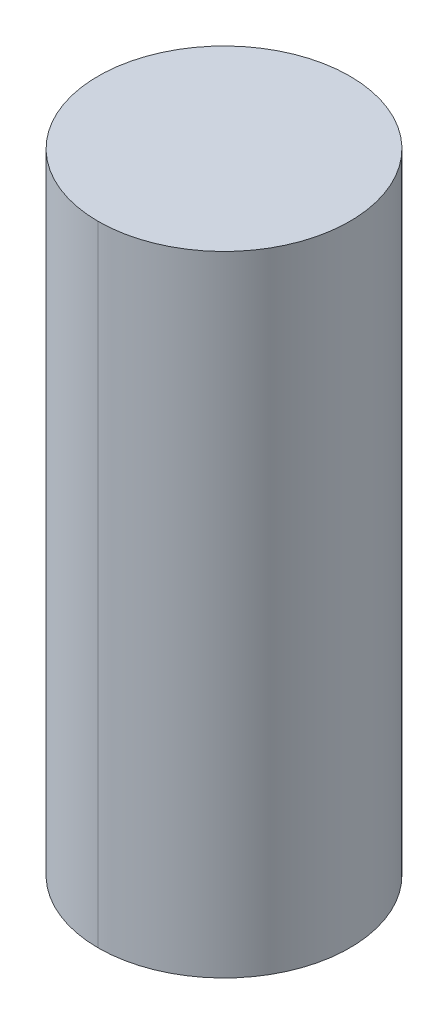
ISO-10303-21;
HEADER;
FILE_DESCRIPTION(('STEP AP214'),'2;1');
FILE_NAME('part.step','',(''),(''),'','','');
FILE_SCHEMA(('AUTOMOTIVE_DESIGN { 1 0 10303 214 1 1 1 1 }'));
ENDSEC;
DATA;
#1=APPLICATION_CONTEXT('core data for automotive mechanical design processes');
#2=APPLICATION_PROTOCOL_DEFINITION('international standard','automotive_design',2000,#1);
#3=PRODUCT_CONTEXT('',#1,'mechanical');
#4=PRODUCT('Part','Part','',(#3));
#5=PRODUCT_RELATED_PRODUCT_CATEGORY('part','',(#4));
#6=PRODUCT_DEFINITION_FORMATION('','',#4);
#7=PRODUCT_DEFINITION_CONTEXT('part definition',#1,'design');
#8=PRODUCT_DEFINITION('design','',#6,#7);
#9=PRODUCT_DEFINITION_SHAPE('','',#8);
#10=(LENGTH_UNIT() NAMED_UNIT(*) SI_UNIT(.MILLI.,.METRE.));
#11=(NAMED_UNIT(*) PLANE_ANGLE_UNIT() SI_UNIT($,.RADIAN.));
#12=(NAMED_UNIT(*) SI_UNIT($,.STERADIAN.) SOLID_ANGLE_UNIT());
#13=UNCERTAINTY_MEASURE_WITH_UNIT(LENGTH_MEASURE(1.E-05),#10,'distance_accuracy_value','');
#14=(GEOMETRIC_REPRESENTATION_CONTEXT(3) GLOBAL_UNCERTAINTY_ASSIGNED_CONTEXT((#13)) GLOBAL_UNIT_ASSIGNED_CONTEXT((#10,
#11,#12)) REPRESENTATION_CONTEXT('',''));
#15=CARTESIAN_POINT('',(0.,0.,0.));
#16=DIRECTION('',(0.,0.,1.));
#17=DIRECTION('',(1.,0.,0.));
#18=AXIS2_PLACEMENT_3D('',#15,#16,#17);
#19=CARTESIAN_POINT('',(0.,13.5,0.));
#20=DIRECTION('',(0.,-1.,0.));
#21=DIRECTION('',(0.,0.,-1.));
#22=AXIS2_PLACEMENT_3D('',#19,#20,#21);
#23=PLANE('',#22);
#24=CARTESIAN_POINT('',(0.,13.5,0.));
#25=DIRECTION('',(0.,-1.,0.));
#26=DIRECTION('',(0.,0.,-1.));
#27=AXIS2_PLACEMENT_3D('',#24,#25,#26);
#28=CIRCLE('',#27,1.);
#29=CARTESIAN_POINT('',(0.,13.5,1.));
#30=VERTEX_POINT('',#29);
#31=CARTESIAN_POINT('',(0.,13.5,-1.));
#32=VERTEX_POINT('',#31);
#33=EDGE_CURVE('E11',#30,#32,#28,.T.);
#34=ORIENTED_EDGE('',*,*,#33,.F.);
#35=CARTESIAN_POINT('',(0.,13.5,0.));
#36=DIRECTION('',(0.,-1.,0.));
#37=DIRECTION('',(0.,0.,-1.));
#38=AXIS2_PLACEMENT_3D('',#35,#36,#37);
#39=CIRCLE('',#38,1.);
#40=EDGE_CURVE('E24',#32,#30,#39,.T.);
#41=ORIENTED_EDGE('',*,*,#40,.F.);
#42=EDGE_LOOP('',(#34,#41));
#43=FACE_BOUND('',#42,.T.);
#44=ADVANCED_FACE('F16',(#43),#23,.F.);
#45=CARTESIAN_POINT('',(0.,8.5,0.));
#46=DIRECTION('',(0.,-1.,0.));
#47=DIRECTION('',(-1.,0.,0.));
#48=AXIS2_PLACEMENT_3D('',#45,#46,#47);
#49=CYLINDRICAL_SURFACE('',#48,1.);
#50=DIRECTION('',(0.,-1.,0.));
#51=VECTOR('',#50,1.);
#52=CARTESIAN_POINT('',(0.,13.5,1.));
#53=LINE('',#52,#51);
#54=CARTESIAN_POINT('',(0.,8.5,1.));
#55=VERTEX_POINT('',#54);
#56=EDGE_CURVE('E44',#30,#55,#53,.T.);
#57=ORIENTED_EDGE('',*,*,#56,.T.);
#58=CARTESIAN_POINT('',(0.,8.5,0.));
#59=DIRECTION('',(0.,-1.,0.));
#60=DIRECTION('',(0.,0.,-1.));
#61=AXIS2_PLACEMENT_3D('',#58,#59,#60);
#62=CIRCLE('',#61,1.);
#63=CARTESIAN_POINT('',(0.,8.5,-1.));
#64=VERTEX_POINT('',#63);
#65=EDGE_CURVE('E40',#64,#55,#62,.T.);
#66=ORIENTED_EDGE('',*,*,#65,.F.);
#67=DIRECTION('',(0.,-1.,0.));
#68=VECTOR('',#67,1.);
#69=CARTESIAN_POINT('',(0.,13.5,-1.));
#70=LINE('',#69,#68);
#71=EDGE_CURVE('E43',#32,#64,#70,.T.);
#72=ORIENTED_EDGE('',*,*,#71,.F.);
#73=ORIENTED_EDGE('',*,*,#40,.T.);
#74=EDGE_LOOP('',(#57,#66,#72,#73));
#75=FACE_BOUND('',#74,.T.);
#76=ADVANCED_FACE('F42',(#75),#49,.T.);
#77=CARTESIAN_POINT('',(0.,8.5,0.));
#78=DIRECTION('',(0.,-1.,0.));
#79=DIRECTION('',(1.,0.,0.));
#80=AXIS2_PLACEMENT_3D('',#77,#78,#79);
#81=CYLINDRICAL_SURFACE('',#80,1.);
#82=ORIENTED_EDGE('',*,*,#56,.F.);
#83=ORIENTED_EDGE('',*,*,#33,.T.);
#84=ORIENTED_EDGE('',*,*,#71,.T.);
#85=CARTESIAN_POINT('',(0.,8.5,0.));
#86=DIRECTION('',(0.,-1.,0.));
#87=DIRECTION('',(0.,0.,-1.));
#88=AXIS2_PLACEMENT_3D('',#85,#86,#87);
#89=CIRCLE('',#88,1.);
#90=EDGE_CURVE('E51',#55,#64,#89,.T.);
#91=ORIENTED_EDGE('',*,*,#90,.F.);
#92=EDGE_LOOP('',(#82,#83,#84,#91));
#93=FACE_BOUND('',#92,.T.);
#94=ADVANCED_FACE('F50',(#93),#81,.T.);
#95=CARTESIAN_POINT('',(0.,8.5,-1.));
#96=DIRECTION('',(0.,1.,0.));
#97=DIRECTION('',(0.,0.,1.));
#98=AXIS2_PLACEMENT_3D('',#95,#96,#97);
#99=PLANE('',#98);
#100=ORIENTED_EDGE('',*,*,#65,.T.);
#101=ORIENTED_EDGE('',*,*,#90,.T.);
#102=EDGE_LOOP('',(#100,#101));
#103=FACE_BOUND('',#102,.T.);
#104=ADVANCED_FACE('F53',(#103),#99,.F.);
#105=CLOSED_SHELL('',(#44,#76,#94,#104));
#106=MANIFOLD_SOLID_BREP('B1',#105);
#107=ADVANCED_BREP_SHAPE_REPRESENTATION('',(#18,#106),#14);
#108=SHAPE_DEFINITION_REPRESENTATION(#9,#107);
ENDSEC;
END-ISO-10303-21;
